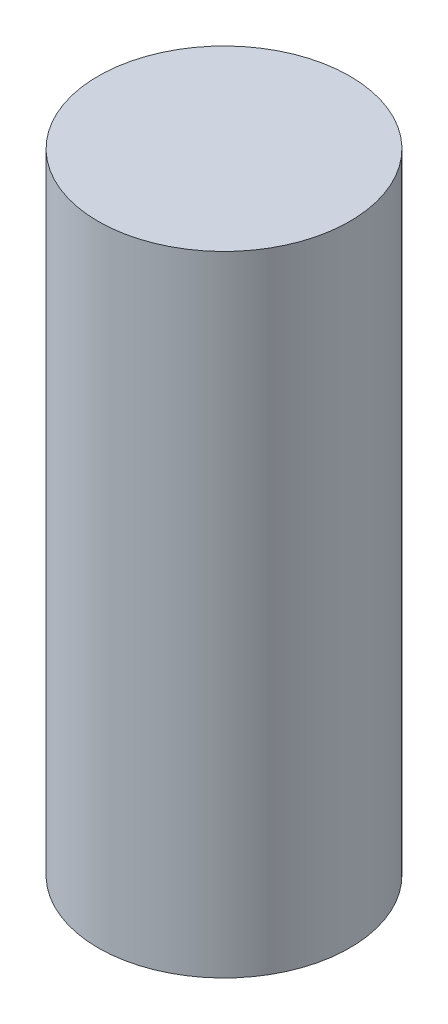
ISO-10303-21;
HEADER;
FILE_DESCRIPTION(('STEP AP214'),'2;1');
FILE_NAME('part.step','',(''),(''),'','','');
FILE_SCHEMA(('AUTOMOTIVE_DESIGN { 1 0 10303 214 1 1 1 1 }'));
ENDSEC;
DATA;
#1=APPLICATION_CONTEXT('core data for automotive mechanical design processes');
#2=APPLICATION_PROTOCOL_DEFINITION('international standard','automotive_design',2000,#1);
#3=PRODUCT_CONTEXT('',#1,'mechanical');
#4=PRODUCT('Part','Part','',(#3));
#5=PRODUCT_RELATED_PRODUCT_CATEGORY('part','',(#4));
#6=PRODUCT_DEFINITION_FORMATION('','',#4);
#7=PRODUCT_DEFINITION_CONTEXT('part definition',#1,'design');
#8=PRODUCT_DEFINITION('design','',#6,#7);
#9=PRODUCT_DEFINITION_SHAPE('','',#8);
#10=(LENGTH_UNIT() NAMED_UNIT(*) SI_UNIT(.MILLI.,.METRE.));
#11=(NAMED_UNIT(*) PLANE_ANGLE_UNIT() SI_UNIT($,.RADIAN.));
#12=(NAMED_UNIT(*) SI_UNIT($,.STERADIAN.) SOLID_ANGLE_UNIT());
#13=UNCERTAINTY_MEASURE_WITH_UNIT(LENGTH_MEASURE(1.E-05),#10,'distance_accuracy_value','');
#14=(GEOMETRIC_REPRESENTATION_CONTEXT(3) GLOBAL_UNCERTAINTY_ASSIGNED_CONTEXT((#13)) GLOBAL_UNIT_ASSIGNED_CONTEXT((#10,
#11,#12)) REPRESENTATION_CONTEXT('',''));
#15=CARTESIAN_POINT('',(0.,0.,0.));
#16=DIRECTION('',(0.,0.,1.));
#17=DIRECTION('',(1.,0.,0.));
#18=AXIS2_PLACEMENT_3D('',#15,#16,#17);
#19=CARTESIAN_POINT('',(0.,20.,0.));
#20=DIRECTION('',(0.,-1.,0.));
#21=DIRECTION('',(0.,0.,-1.));
#22=AXIS2_PLACEMENT_3D('',#19,#20,#21);
#23=CYLINDRICAL_SURFACE('',#22,4.);
#24=CARTESIAN_POINT('',(0.,20.,0.));
#25=DIRECTION('',(0.,1.,0.));
#26=DIRECTION('',(0.,0.,1.));
#27=AXIS2_PLACEMENT_3D('',#24,#25,#26);
#28=CIRCLE('',#27,4.);
#29=CARTESIAN_POINT('',(0.,20.,4.));
#30=VERTEX_POINT('',#29);
#31=EDGE_CURVE('E10',#30,#30,#28,.T.);
#32=ORIENTED_EDGE('',*,*,#31,.F.);
#33=EDGE_LOOP('',(#32));
#34=FACE_BOUND('',#33,.T.);
#35=CARTESIAN_POINT('',(0.,0.,0.));
#36=DIRECTION('',(0.,1.,0.));
#37=DIRECTION('',(0.,0.,1.));
#38=AXIS2_PLACEMENT_3D('',#35,#36,#37);
#39=CIRCLE('',#38,4.);
#40=CARTESIAN_POINT('',(0.,0.,4.));
#41=VERTEX_POINT('',#40);
#42=EDGE_CURVE('E38',#41,#41,#39,.T.);
#43=ORIENTED_EDGE('',*,*,#42,.T.);
#44=EDGE_LOOP('',(#43));
#45=FACE_BOUND('',#44,.T.);
#46=ADVANCED_FACE('F35',(#34,#45),#23,.T.);
#47=CARTESIAN_POINT('',(0.,20.,0.));
#48=DIRECTION('',(0.,1.,0.));
#49=DIRECTION('',(0.,0.,1.));
#50=AXIS2_PLACEMENT_3D('',#47,#48,#49);
#51=PLANE('',#50);
#52=ORIENTED_EDGE('',*,*,#31,.T.);
#53=EDGE_LOOP('',(#52));
#54=FACE_BOUND('',#53,.T.);
#55=ADVANCED_FACE('F50',(#54),#51,.T.);
#56=CARTESIAN_POINT('',(0.,0.,0.));
#57=DIRECTION('',(0.,1.,0.));
#58=DIRECTION('',(0.,0.,1.));
#59=AXIS2_PLACEMENT_3D('',#56,#57,#58);
#60=PLANE('',#59);
#61=ORIENTED_EDGE('',*,*,#42,.F.);
#62=EDGE_LOOP('',(#61));
#63=FACE_BOUND('',#62,.T.);
#64=ADVANCED_FACE('F48',(#63),#60,.F.);
#65=CLOSED_SHELL('',(#46,#55,#64));
#66=MANIFOLD_SOLID_BREP('B2',#65);
#67=ADVANCED_BREP_SHAPE_REPRESENTATION('',(#18,#66),#14);
#68=SHAPE_DEFINITION_REPRESENTATION(#9,#67);
ENDSEC;
END-ISO-10303-21;
